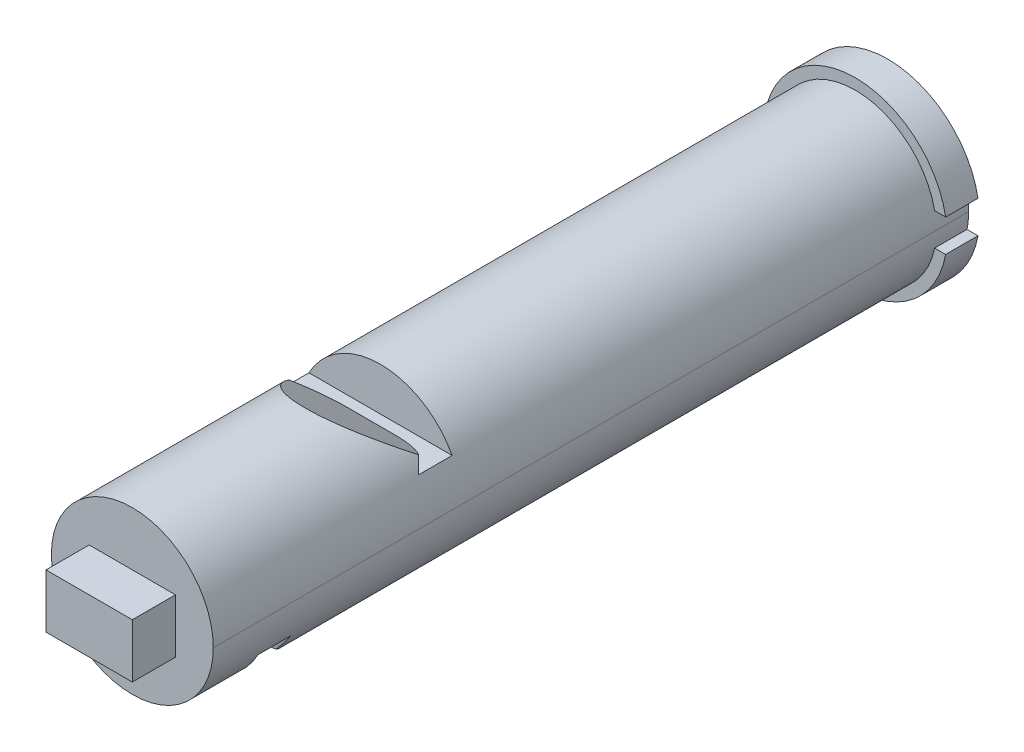
ISO-10303-21;
HEADER;
FILE_DESCRIPTION(('STEP AP214'),'2;1');
FILE_NAME('part.step','',(''),(''),'','','');
FILE_SCHEMA(('AUTOMOTIVE_DESIGN { 1 0 10303 214 1 1 1 1 }'));
ENDSEC;
DATA;
#1=APPLICATION_CONTEXT('core data for automotive mechanical design processes');
#2=APPLICATION_PROTOCOL_DEFINITION('international standard','automotive_design',2000,#1);
#3=PRODUCT_CONTEXT('',#1,'mechanical');
#4=PRODUCT('Part','Part','',(#3));
#5=PRODUCT_RELATED_PRODUCT_CATEGORY('part','',(#4));
#6=PRODUCT_DEFINITION_FORMATION('','',#4);
#7=PRODUCT_DEFINITION_CONTEXT('part definition',#1,'design');
#8=PRODUCT_DEFINITION('design','',#6,#7);
#9=PRODUCT_DEFINITION_SHAPE('','',#8);
#10=(LENGTH_UNIT() NAMED_UNIT(*) SI_UNIT(.MILLI.,.METRE.));
#11=(NAMED_UNIT(*) PLANE_ANGLE_UNIT() SI_UNIT($,.RADIAN.));
#12=(NAMED_UNIT(*) SI_UNIT($,.STERADIAN.) SOLID_ANGLE_UNIT());
#13=UNCERTAINTY_MEASURE_WITH_UNIT(LENGTH_MEASURE(1.E-05),#10,'distance_accuracy_value','');
#14=(GEOMETRIC_REPRESENTATION_CONTEXT(3) GLOBAL_UNCERTAINTY_ASSIGNED_CONTEXT((#13)) GLOBAL_UNIT_ASSIGNED_CONTEXT((#10,
#11,#12)) REPRESENTATION_CONTEXT('',''));
#15=CARTESIAN_POINT('',(0.,0.,0.));
#16=DIRECTION('',(0.,0.,1.));
#17=DIRECTION('',(1.,0.,0.));
#18=AXIS2_PLACEMENT_3D('',#15,#16,#17);
#19=CARTESIAN_POINT('',(0.,0.,74.));
#20=DIRECTION('',(0.,0.,1.));
#21=DIRECTION('',(1.,0.,0.));
#22=AXIS2_PLACEMENT_3D('',#19,#20,#21);
#23=PLANE('',#22);
#24=DIRECTION('',(0.,-1.,0.));
#25=VECTOR('',#24,1.);
#26=CARTESIAN_POINT('',(-4.,2.5,74.));
#27=LINE('',#26,#25);
#28=CARTESIAN_POINT('',(-4.,2.5,74.));
#29=VERTEX_POINT('',#28);
#30=CARTESIAN_POINT('',(-4.,-2.5,74.));
#31=VERTEX_POINT('',#30);
#32=EDGE_CURVE('E247',#29,#31,#27,.T.);
#33=ORIENTED_EDGE('',*,*,#32,.T.);
#34=DIRECTION('',(1.,0.,0.));
#35=VECTOR('',#34,1.);
#36=CARTESIAN_POINT('',(-4.,-2.5,74.));
#37=LINE('',#36,#35);
#38=CARTESIAN_POINT('',(4.,-2.5,74.));
#39=VERTEX_POINT('',#38);
#40=EDGE_CURVE('E214',#31,#39,#37,.T.);
#41=ORIENTED_EDGE('',*,*,#40,.T.);
#42=DIRECTION('',(0.,1.,0.));
#43=VECTOR('',#42,1.);
#44=CARTESIAN_POINT('',(4.,2.5,74.));
#45=LINE('',#44,#43);
#46=CARTESIAN_POINT('',(4.,2.5,74.));
#47=VERTEX_POINT('',#46);
#48=EDGE_CURVE('E27',#39,#47,#45,.T.);
#49=ORIENTED_EDGE('',*,*,#48,.T.);
#50=DIRECTION('',(-1.,0.,0.));
#51=VECTOR('',#50,1.);
#52=CARTESIAN_POINT('',(-4.,2.5,74.));
#53=LINE('',#52,#51);
#54=EDGE_CURVE('E9',#47,#29,#53,.T.);
#55=ORIENTED_EDGE('',*,*,#54,.T.);
#56=EDGE_LOOP('',(#33,#41,#49,#55));
#57=FACE_BOUND('',#56,.T.);
#58=ADVANCED_FACE('F14',(#57),#23,.T.);
#59=CARTESIAN_POINT('',(-4.,2.5,74.));
#60=DIRECTION('',(0.,-1.,0.));
#61=DIRECTION('',(0.,0.,-1.));
#62=AXIS2_PLACEMENT_3D('',#59,#60,#61);
#63=PLANE('',#62);
#64=DIRECTION('',(-1.,0.,0.));
#65=VECTOR('',#64,1.);
#66=CARTESIAN_POINT('',(-4.,2.5,70.));
#67=LINE('',#66,#65);
#68=CARTESIAN_POINT('',(4.,2.5,70.));
#69=VERTEX_POINT('',#68);
#70=CARTESIAN_POINT('',(-4.,2.5,70.));
#71=VERTEX_POINT('',#70);
#72=EDGE_CURVE('E224',#69,#71,#67,.T.);
#73=ORIENTED_EDGE('',*,*,#72,.T.);
#74=DIRECTION('',(0.,0.,-1.));
#75=VECTOR('',#74,1.);
#76=CARTESIAN_POINT('',(-4.,2.5,74.));
#77=LINE('',#76,#75);
#78=EDGE_CURVE('E215',#29,#71,#77,.T.);
#79=ORIENTED_EDGE('',*,*,#78,.F.);
#80=ORIENTED_EDGE('',*,*,#54,.F.);
#81=DIRECTION('',(0.,0.,-1.));
#82=VECTOR('',#81,1.);
#83=CARTESIAN_POINT('',(4.,2.5,74.));
#84=LINE('',#83,#82);
#85=EDGE_CURVE('E298',#47,#69,#84,.T.);
#86=ORIENTED_EDGE('',*,*,#85,.T.);
#87=EDGE_LOOP('',(#73,#79,#80,#86));
#88=FACE_BOUND('',#87,.T.);
#89=ADVANCED_FACE('F562',(#88),#63,.F.);
#90=CARTESIAN_POINT('',(4.,2.5,74.));
#91=DIRECTION('',(-1.,0.,0.));
#92=DIRECTION('',(0.,0.,1.));
#93=AXIS2_PLACEMENT_3D('',#90,#91,#92);
#94=PLANE('',#93);
#95=DIRECTION('',(0.,1.,0.));
#96=VECTOR('',#95,1.);
#97=CARTESIAN_POINT('',(4.,2.5,70.));
#98=LINE('',#97,#96);
#99=CARTESIAN_POINT('',(4.,-2.5,70.));
#100=VERTEX_POINT('',#99);
#101=EDGE_CURVE('E208',#100,#69,#98,.T.);
#102=ORIENTED_EDGE('',*,*,#101,.T.);
#103=ORIENTED_EDGE('',*,*,#85,.F.);
#104=ORIENTED_EDGE('',*,*,#48,.F.);
#105=DIRECTION('',(0.,0.,-1.));
#106=VECTOR('',#105,1.);
#107=CARTESIAN_POINT('',(4.,-2.5,74.));
#108=LINE('',#107,#106);
#109=EDGE_CURVE('E204',#39,#100,#108,.T.);
#110=ORIENTED_EDGE('',*,*,#109,.T.);
#111=EDGE_LOOP('',(#102,#103,#104,#110));
#112=FACE_BOUND('',#111,.T.);
#113=ADVANCED_FACE('F206',(#112),#94,.F.);
#114=CARTESIAN_POINT('',(-4.,-2.5,74.));
#115=DIRECTION('',(0.,1.,0.));
#116=DIRECTION('',(1.,0.,0.));
#117=AXIS2_PLACEMENT_3D('',#114,#115,#116);
#118=PLANE('',#117);
#119=DIRECTION('',(1.,0.,0.));
#120=VECTOR('',#119,1.);
#121=CARTESIAN_POINT('',(-4.,-2.5,70.));
#122=LINE('',#121,#120);
#123=CARTESIAN_POINT('',(-4.,-2.5,70.));
#124=VERTEX_POINT('',#123);
#125=EDGE_CURVE('E222',#124,#100,#122,.T.);
#126=ORIENTED_EDGE('',*,*,#125,.T.);
#127=ORIENTED_EDGE('',*,*,#109,.F.);
#128=ORIENTED_EDGE('',*,*,#40,.F.);
#129=DIRECTION('',(0.,0.,-1.));
#130=VECTOR('',#129,1.);
#131=CARTESIAN_POINT('',(-4.,-2.5,74.));
#132=LINE('',#131,#130);
#133=EDGE_CURVE('E230',#31,#124,#132,.T.);
#134=ORIENTED_EDGE('',*,*,#133,.T.);
#135=EDGE_LOOP('',(#126,#127,#128,#134));
#136=FACE_BOUND('',#135,.T.);
#137=ADVANCED_FACE('F228',(#136),#118,.F.);
#138=CARTESIAN_POINT('',(-4.,2.5,74.));
#139=DIRECTION('',(1.,0.,0.));
#140=DIRECTION('',(0.,1.,0.));
#141=AXIS2_PLACEMENT_3D('',#138,#139,#140);
#142=PLANE('',#141);
#143=DIRECTION('',(0.,-1.,0.));
#144=VECTOR('',#143,1.);
#145=CARTESIAN_POINT('',(-4.,2.5,70.));
#146=LINE('',#145,#144);
#147=EDGE_CURVE('E233',#71,#124,#146,.T.);
#148=ORIENTED_EDGE('',*,*,#147,.T.);
#149=ORIENTED_EDGE('',*,*,#133,.F.);
#150=ORIENTED_EDGE('',*,*,#32,.F.);
#151=ORIENTED_EDGE('',*,*,#78,.T.);
#152=EDGE_LOOP('',(#148,#149,#150,#151));
#153=FACE_BOUND('',#152,.T.);
#154=ADVANCED_FACE('F552',(#153),#142,.F.);
#155=CARTESIAN_POINT('',(-8.36660026534076,-3.5,64.));
#156=DIRECTION('',(0.,0.78086880944303,-0.624695047554425));
#157=DIRECTION('',(-1.,0.,0.));
#158=AXIS2_PLACEMENT_3D('',#155,#156,#157);
#159=PLANE('',#158);
#160=DIRECTION('',(1.,0.,0.));
#161=VECTOR('',#160,1.);
#162=CARTESIAN_POINT('',(0.,-3.5,64.));
#163=LINE('',#162,#161);
#164=CARTESIAN_POINT('',(-2.5,-3.5,64.));
#165=VERTEX_POINT('',#164);
#166=CARTESIAN_POINT('',(2.5,-3.5,64.));
#167=VERTEX_POINT('',#166);
#168=EDGE_CURVE('E258',#165,#167,#163,.T.);
#169=ORIENTED_EDGE('',*,*,#168,.F.);
#170=CARTESIAN_POINT('',(-2.5,-3.5,64.));
#171=CARTESIAN_POINT('',(-3.76535257547479,-3.57826350727732,63.9021706159034));
#172=CARTESIAN_POINT('',(-4.9395349648415,-3.96358078550256,63.4205240181218));
#173=CARTESIAN_POINT('',(-5.90909547281453,-4.61872175966066,62.6015978004242));
#174=(BOUNDED_CURVE() B_SPLINE_CURVE(3,(#170,#171,#172,#173),.UNSPECIFIED.,.F.,
.F.) B_SPLINE_CURVE_WITH_KNOTS((4,4),(3.21875309003642,3.84296469095115),
.UNSPECIFIED.) CURVE() GEOMETRIC_REPRESENTATION_ITEM() RATIONAL_B_SPLINE_CURVE((1.,
0.96779271082216,0.96779271082216,1.)) REPRESENTATION_ITEM(''));
#175=CARTESIAN_POINT('',(-5.90909547281453,-4.61872175966066,62.6015978004242));
#176=VERTEX_POINT('',#175);
#177=EDGE_CURVE('E352',#165,#176,#174,.T.);
#178=ORIENTED_EDGE('',*,*,#177,.T.);
#179=CARTESIAN_POINT('',(5.90909547281453,-4.61872175966066,62.6015978004242));
#180=CARTESIAN_POINT('',(2.64784857944101,-8.79109244058685,57.3861344492665));
#181=CARTESIAN_POINT('',(-2.647848579441,-8.79109244058685,57.3861344492665));
#182=CARTESIAN_POINT('',(-5.90909547281453,-4.61872175966066,62.6015978004242));
#183=(BOUNDED_CURVE() B_SPLINE_CURVE(3,(#179,#180,#181,#182),.UNSPECIFIED.,.F.,
.F.) B_SPLINE_CURVE_WITH_KNOTS((4,4),(5.37582742653039,7.19054318782878),
.UNSPECIFIED.) CURVE() GEOMETRIC_REPRESENTATION_ITEM() RATIONAL_B_SPLINE_CURVE((1.,
0.743886378636503,0.743886378636503,1.)) REPRESENTATION_ITEM(''));
#184=CARTESIAN_POINT('',(5.90909547281453,-4.61872175966066,62.6015978004242));
#185=VERTEX_POINT('',#184);
#186=EDGE_CURVE('E513',#185,#176,#183,.T.);
#187=ORIENTED_EDGE('',*,*,#186,.F.);
#188=CARTESIAN_POINT('',(2.5,-3.5,64.));
#189=CARTESIAN_POINT('',(3.7653525754748,-3.57826350727732,63.9021706159034));
#190=CARTESIAN_POINT('',(4.9395349648415,-3.96358078550256,63.4205240181218));
#191=CARTESIAN_POINT('',(5.90909547281453,-4.61872175966066,62.6015978004242));
#192=(BOUNDED_CURVE() B_SPLINE_CURVE(3,(#188,#189,#190,#191),.UNSPECIFIED.,.F.,
.F.) B_SPLINE_CURVE_WITH_KNOTS((4,4),(3.21875309003642,3.84296469095115),
.UNSPECIFIED.) CURVE() GEOMETRIC_REPRESENTATION_ITEM() RATIONAL_B_SPLINE_CURVE((1.,
0.96779271082216,0.96779271082216,1.)) REPRESENTATION_ITEM(''));
#193=EDGE_CURVE('E365',#167,#185,#192,.T.);
#194=ORIENTED_EDGE('',*,*,#193,.F.);
#195=EDGE_LOOP('',(#169,#178,#187,#194));
#196=FACE_BOUND('',#195,.T.);
#197=ADVANCED_FACE('F331',(#196),#159,.F.);
#198=CARTESIAN_POINT('',(0.,-3.5,0.));
#199=DIRECTION('',(0.,1.,0.));
#200=DIRECTION('',(1.,0.,0.));
#201=AXIS2_PLACEMENT_3D('',#198,#199,#200);
#202=PLANE('',#201);
#203=CARTESIAN_POINT('',(-2.03749663721766,-3.5,58.0178523388824));
#204=DIRECTION('',(0.,-1.,0.));
#205=DIRECTION('',(0.,0.,1.));
#206=AXIS2_PLACEMENT_3D('',#203,#204,#205);
#207=CIRCLE('',#206,6.);
#208=CARTESIAN_POINT('',(-6.6332495807108,-3.5,61.8751901361688));
#209=VERTEX_POINT('',#208);
#210=EDGE_CURVE('E343',#165,#209,#207,.T.);
#211=ORIENTED_EDGE('',*,*,#210,.F.);
#212=ORIENTED_EDGE('',*,*,#168,.T.);
#213=CARTESIAN_POINT('',(2.03749663721766,-3.5,58.0178523388824));
#214=DIRECTION('',(0.,1.,0.));
#215=DIRECTION('',(0.,0.,1.));
#216=AXIS2_PLACEMENT_3D('',#213,#214,#215);
#217=CIRCLE('',#216,6.);
#218=CARTESIAN_POINT('',(6.6332495807108,-3.5,61.8751901361688));
#219=VERTEX_POINT('',#218);
#220=EDGE_CURVE('E528',#167,#219,#217,.T.);
#221=ORIENTED_EDGE('',*,*,#220,.T.);
#222=DIRECTION('',(0.,0.,-1.));
#223=VECTOR('',#222,1.);
#224=CARTESIAN_POINT('',(6.6332495807108,-3.5,70.));
#225=LINE('',#224,#223);
#226=CARTESIAN_POINT('',(6.6332495807108,-3.5,65.));
#227=VERTEX_POINT('',#226);
#228=EDGE_CURVE('E531',#227,#219,#225,.T.);
#229=ORIENTED_EDGE('',*,*,#228,.F.);
#230=DIRECTION('',(1.,0.,0.));
#231=VECTOR('',#230,1.);
#232=CARTESIAN_POINT('',(0.,-3.5,65.));
#233=LINE('',#232,#231);
#234=CARTESIAN_POINT('',(-6.6332495807108,-3.5,65.));
#235=VERTEX_POINT('',#234);
#236=EDGE_CURVE('E262',#235,#227,#233,.T.);
#237=ORIENTED_EDGE('',*,*,#236,.F.);
#238=DIRECTION('',(0.,0.,1.));
#239=VECTOR('',#238,1.);
#240=CARTESIAN_POINT('',(-6.6332495807108,-3.5,70.));
#241=LINE('',#240,#239);
#242=EDGE_CURVE('E355',#209,#235,#241,.T.);
#243=ORIENTED_EDGE('',*,*,#242,.F.);
#244=EDGE_LOOP('',(#211,#212,#221,#229,#237,#243));
#245=FACE_BOUND('',#244,.T.);
#246=ADVANCED_FACE('F333',(#245),#202,.F.);
#247=CARTESIAN_POINT('',(0.,-3.5,65.));
#248=DIRECTION('',(0.,0.,-1.));
#249=DIRECTION('',(0.,-1.,0.));
#250=AXIS2_PLACEMENT_3D('',#247,#248,#249);
#251=PLANE('',#250);
#252=ORIENTED_EDGE('',*,*,#236,.T.);
#253=CARTESIAN_POINT('',(0.,0.,65.));
#254=DIRECTION('',(0.,0.,-1.));
#255=DIRECTION('',(-1.,0.,0.));
#256=AXIS2_PLACEMENT_3D('',#253,#254,#255);
#257=CIRCLE('',#256,7.5);
#258=EDGE_CURVE('E359',#227,#235,#257,.T.);
#259=ORIENTED_EDGE('',*,*,#258,.T.);
#260=EDGE_LOOP('',(#252,#259));
#261=FACE_BOUND('',#260,.T.);
#262=ADVANCED_FACE('F496',(#261),#251,.T.);
#263=CARTESIAN_POINT('',(-2.03749663721766,-3.5,58.0178523388824));
#264=DIRECTION('',(0.,-1.,0.));
#265=DIRECTION('',(0.,0.,-1.));
#266=AXIS2_PLACEMENT_3D('',#263,#264,#265);
#267=CYLINDRICAL_SURFACE('',#266,6.);
#268=ORIENTED_EDGE('',*,*,#177,.F.);
#269=ORIENTED_EDGE('',*,*,#210,.T.);
#270=CARTESIAN_POINT('',(-6.63324958071079,-3.5,61.8751901361688));
#271=CARTESIAN_POINT('',(-6.60766445779467,-3.54848999734944,61.9056732477275));
#272=CARTESIAN_POINT('',(-6.58155732357122,-3.59670137673546,61.9361620128673));
#273=CARTESIAN_POINT('',(-6.52822835245083,-3.69266909430324,61.9971705534921));
#274=CARTESIAN_POINT('',(-6.50100414653086,-3.74042416921239,62.0276902451331));
#275=CARTESIAN_POINT('',(-6.44541754870242,-3.83547927883045,62.0887172353045));
#276=CARTESIAN_POINT('',(-6.41705255090779,-3.88277792522175,62.1192243233681));
#277=CARTESIAN_POINT('',(-6.35916230193235,-3.97692033582182,62.1801806790338));
#278=CARTESIAN_POINT('',(-6.32963420978387,-4.02376258647017,62.2106295866339));
#279=CARTESIAN_POINT('',(-6.26939660479633,-4.11699231932294,62.2714224690449));
#280=CARTESIAN_POINT('',(-6.23868401755144,-4.1633781623944,62.3017659118861));
#281=CARTESIAN_POINT('',(-6.17605748138752,-4.25569521629385,62.3622989559095));
#282=CARTESIAN_POINT('',(-6.14414022822785,-4.30162466260147,62.3924878301928));
#283=CARTESIAN_POINT('',(-6.07908550729933,-4.39302901431333,62.4526610853297));
#284=CARTESIAN_POINT('',(-6.04594450974329,-4.43850203012709,62.4826445213913));
#285=CARTESIAN_POINT('',(-5.97842543548276,-4.52899376853106,62.5423543763314));
#286=CARTESIAN_POINT('',(-5.94404361172873,-4.57401047774772,62.5720796090721));
#287=CARTESIAN_POINT('',(-5.90909547281453,-4.61872175966066,62.6015978004242));
#288=B_SPLINE_CURVE_WITH_KNOTS('',3,(#270,#271,#272,#273,#274,#275,#276,#277,#278,#279,#280,
#281,#282,#283,#284,#285,#286,#287),.UNSPECIFIED.,.F.,.F.,(4,2,2,2,2,2,2,2,4),(0.,
0.18818873002691,0.376799584578778,0.565868922970052,0.755432840483016,0.945527150449584,
1.1361873670971,1.32744868918957,1.51934598449119),.UNSPECIFIED.);
#289=EDGE_CURVE('E360',#209,#176,#288,.T.);
#290=ORIENTED_EDGE('',*,*,#289,.T.);
#291=EDGE_LOOP('',(#268,#269,#290));
#292=FACE_BOUND('',#291,.T.);
#293=ADVANCED_FACE('F492',(#292),#267,.T.);
#294=CARTESIAN_POINT('',(2.03749663721766,-3.5,58.0178523388824));
#295=DIRECTION('',(0.,-1.,0.));
#296=DIRECTION('',(0.,0.,-1.));
#297=AXIS2_PLACEMENT_3D('',#294,#295,#296);
#298=CYLINDRICAL_SURFACE('',#297,6.);
#299=ORIENTED_EDGE('',*,*,#220,.F.);
#300=ORIENTED_EDGE('',*,*,#193,.T.);
#301=CARTESIAN_POINT('',(6.6332495807108,-3.5,61.8751901361688));
#302=CARTESIAN_POINT('',(6.59994174456403,-3.56312517064248,61.9148690724093));
#303=CARTESIAN_POINT('',(6.56572889529886,-3.62578298119048,61.9545312227294));
#304=CARTESIAN_POINT('',(6.50070564838672,-3.74092591804646,62.0279096757643));
#305=CARTESIAN_POINT('',(6.47014164196022,-3.79354345265774,62.0616367252062));
#306=CARTESIAN_POINT('',(6.41314301273647,-3.88897490838058,62.1231509953634));
#307=CARTESIAN_POINT('',(6.38691409372833,-3.93190309895028,62.1509516409813));
#308=CARTESIAN_POINT('',(6.33917470360601,-4.00829689832601,62.2005959118438));
#309=CARTESIAN_POINT('',(6.31783256037368,-4.0418531050118,62.2224622258888));
#310=CARTESIAN_POINT('',(6.26351526881085,-4.12577205314536,62.2772229485628));
#311=CARTESIAN_POINT('',(6.23017409402149,-4.17595115646073,62.3100367801728));
#312=CARTESIAN_POINT('',(6.16402383449918,-4.27294628912458,62.3736361971242));
#313=CARTESIAN_POINT('',(6.13128180616043,-4.31979855667613,62.4044363270807));
#314=CARTESIAN_POINT('',(6.06651954703337,-4.41024454789595,62.4639940323651));
#315=CARTESIAN_POINT('',(6.03456315543465,-4.45387274674841,62.4927686420104));
#316=CARTESIAN_POINT('',(5.97155111165617,-4.5379697154745,62.5482720189896));
#317=CARTESIAN_POINT('',(5.94055613630613,-4.57847121701588,62.5750201024425));
#318=CARTESIAN_POINT('',(5.90909547281454,-4.61872175966065,62.6015978004242));
#319=B_SPLINE_CURVE_WITH_KNOTS('',3,(#301,#302,#303,#304,#305,#306,#307,#308,#309,#310,#311,
#312,#313,#314,#315,#316,#317,#318),.UNSPECIFIED.,.F.,.F.,(4,2,2,2,2,2,2,2,4),(0.,
0.24497748672245,0.453678065600906,0.626101316091831,0.762247169424045,0.968037802030301,
1.16281237113585,1.34657563843075,1.51933328965343),.UNSPECIFIED.);
#320=EDGE_CURVE('E313',#219,#185,#319,.T.);
#321=ORIENTED_EDGE('',*,*,#320,.F.);
#322=EDGE_LOOP('',(#299,#300,#321));
#323=FACE_BOUND('',#322,.T.);
#324=ADVANCED_FACE('F495',(#323),#298,.T.);
#325=CARTESIAN_POINT('',(-8.36660026534076,-19.7307692307693,13.1538461538462));
#326=DIRECTION('',(0.,0.832050294337844,-0.554700196225229));
#327=DIRECTION('',(-1.,0.,0.));
#328=AXIS2_PLACEMENT_3D('',#325,#326,#327);
#329=PLANE('',#328);
#330=CARTESIAN_POINT('',(6.00805782338563,4.48923614781566,49.4838542217235));
#331=CARTESIAN_POINT('',(5.02218679058538,3.90909595166588,48.6136439274989));
#332=CARTESIAN_POINT('',(3.81108078485515,3.56757654120511,48.1013648118077));
#333=CARTESIAN_POINT('',(2.5,3.5,48.));
#334=(BOUNDED_CURVE() B_SPLINE_CURVE(3,(#330,#331,#332,#333),.UNSPECIFIED.,.F.,
.F.) B_SPLINE_CURVE_WITH_KNOTS((4,4),(2.4184284976934,3.06443221714317),
.UNSPECIFIED.) CURVE() GEOMETRIC_REPRESENTATION_ITEM() RATIONAL_B_SPLINE_CURVE((1.,
0.965524571971836,0.965524571971836,1.)) REPRESENTATION_ITEM(''));
#335=CARTESIAN_POINT('',(6.00805782338563,4.48923614781566,49.4838542217235));
#336=VERTEX_POINT('',#335);
#337=CARTESIAN_POINT('',(2.5,3.5,48.));
#338=VERTEX_POINT('',#337);
#339=EDGE_CURVE('E431',#336,#338,#334,.T.);
#340=ORIENTED_EDGE('',*,*,#339,.T.);
#341=DIRECTION('',(1.,0.,0.));
#342=VECTOR('',#341,1.);
#343=CARTESIAN_POINT('',(0.,3.5,48.));
#344=LINE('',#343,#342);
#345=CARTESIAN_POINT('',(-2.5,3.5,48.));
#346=VERTEX_POINT('',#345);
#347=EDGE_CURVE('E81',#346,#338,#344,.T.);
#348=ORIENTED_EDGE('',*,*,#347,.F.);
#349=CARTESIAN_POINT('',(-6.00805782338563,4.48923614781565,49.4838542217235));
#350=CARTESIAN_POINT('',(-5.02218679058539,3.90909595166589,48.6136439274988));
#351=CARTESIAN_POINT('',(-3.81108078485515,3.5675765412051,48.1013648118077));
#352=CARTESIAN_POINT('',(-2.5,3.5,48.));
#353=(BOUNDED_CURVE() B_SPLINE_CURVE(3,(#349,#350,#351,#352),.UNSPECIFIED.,.F.,
.F.) B_SPLINE_CURVE_WITH_KNOTS((4,4),(2.4184284976934,3.06443221714316),
.UNSPECIFIED.) CURVE() GEOMETRIC_REPRESENTATION_ITEM() RATIONAL_B_SPLINE_CURVE((1.,
0.965524571971837,0.965524571971837,1.)) REPRESENTATION_ITEM(''));
#354=CARTESIAN_POINT('',(-6.00805782338563,4.48923614781565,49.4838542217235));
#355=VERTEX_POINT('',#354);
#356=EDGE_CURVE('E416',#355,#346,#353,.T.);
#357=ORIENTED_EDGE('',*,*,#356,.F.);
#358=CARTESIAN_POINT('',(-6.00805782338563,4.48923614781565,49.4838542217235));
#359=CARTESIAN_POINT('',(-2.73450310605179,8.87031688898545,56.0554753334781));
#360=CARTESIAN_POINT('',(2.73450310605179,8.87031688898546,56.0554753334781));
#361=CARTESIAN_POINT('',(6.00805782338563,4.48923614781566,49.4838542217235));
#362=(BOUNDED_CURVE() B_SPLINE_CURVE(3,(#358,#359,#360,#361),.UNSPECIFIED.,.F.,
.F.) B_SPLINE_CURVE_WITH_KNOTS((4,4),(2.212504664524,4.07068064265559),
.UNSPECIFIED.) CURVE() GEOMETRIC_REPRESENTATION_ITEM() RATIONAL_B_SPLINE_CURVE((1.,
0.732376546472503,0.732376546472503,1.)) REPRESENTATION_ITEM(''));
#363=EDGE_CURVE('E252',#355,#336,#362,.T.);
#364=ORIENTED_EDGE('',*,*,#363,.T.);
#365=EDGE_LOOP('',(#340,#348,#357,#364));
#366=FACE_BOUND('',#365,.T.);
#367=ADVANCED_FACE('F549',(#366),#329,.T.);
#368=CARTESIAN_POINT('',(0.,3.5,0.));
#369=DIRECTION('',(0.,-1.,0.));
#370=DIRECTION('',(0.,0.,-1.));
#371=AXIS2_PLACEMENT_3D('',#368,#369,#370);
#372=PLANE('',#371);
#373=DIRECTION('',(1.,0.,0.));
#374=VECTOR('',#373,1.);
#375=CARTESIAN_POINT('',(0.,3.5,47.));
#376=LINE('',#375,#374);
#377=CARTESIAN_POINT('',(-6.6332495807108,3.5,47.));
#378=VERTEX_POINT('',#377);
#379=CARTESIAN_POINT('',(6.6332495807108,3.5,47.));
#380=VERTEX_POINT('',#379);
#381=EDGE_CURVE('E607',#378,#380,#376,.T.);
#382=ORIENTED_EDGE('',*,*,#381,.F.);
#383=DIRECTION('',(0.,0.,-1.));
#384=VECTOR('',#383,1.);
#385=CARTESIAN_POINT('',(-6.6332495807108,3.5,70.));
#386=LINE('',#385,#384);
#387=CARTESIAN_POINT('',(-6.6332495807108,3.5,50.1248098638313));
#388=VERTEX_POINT('',#387);
#389=EDGE_CURVE('E277',#388,#378,#386,.T.);
#390=ORIENTED_EDGE('',*,*,#389,.F.);
#391=CARTESIAN_POINT('',(-2.03749663721766,3.5,53.9821476611176));
#392=DIRECTION('',(0.,1.,0.));
#393=DIRECTION('',(0.,0.,-1.));
#394=AXIS2_PLACEMENT_3D('',#391,#392,#393);
#395=CIRCLE('',#394,6.);
#396=EDGE_CURVE('E406',#346,#388,#395,.T.);
#397=ORIENTED_EDGE('',*,*,#396,.F.);
#398=ORIENTED_EDGE('',*,*,#347,.T.);
#399=CARTESIAN_POINT('',(2.03749663721766,3.5,53.9821476611176));
#400=DIRECTION('',(0.,-1.,0.));
#401=DIRECTION('',(0.,0.,-1.));
#402=AXIS2_PLACEMENT_3D('',#399,#400,#401);
#403=CIRCLE('',#402,6.);
#404=CARTESIAN_POINT('',(6.6332495807108,3.5,50.1248098638313));
#405=VERTEX_POINT('',#404);
#406=EDGE_CURVE('E426',#338,#405,#403,.T.);
#407=ORIENTED_EDGE('',*,*,#406,.T.);
#408=DIRECTION('',(0.,0.,1.));
#409=VECTOR('',#408,1.);
#410=CARTESIAN_POINT('',(6.6332495807108,3.5,70.));
#411=LINE('',#410,#409);
#412=EDGE_CURVE('E276',#380,#405,#411,.T.);
#413=ORIENTED_EDGE('',*,*,#412,.F.);
#414=EDGE_LOOP('',(#382,#390,#397,#398,#407,#413));
#415=FACE_BOUND('',#414,.T.);
#416=ADVANCED_FACE('F482',(#415),#372,.F.);
#417=CARTESIAN_POINT('',(0.,3.5,47.));
#418=DIRECTION('',(0.,0.,1.));
#419=DIRECTION('',(1.,0.,0.));
#420=AXIS2_PLACEMENT_3D('',#417,#418,#419);
#421=PLANE('',#420);
#422=ORIENTED_EDGE('',*,*,#381,.T.);
#423=CARTESIAN_POINT('',(0.,0.,47.));
#424=DIRECTION('',(0.,0.,1.));
#425=DIRECTION('',(1.,0.,0.));
#426=AXIS2_PLACEMENT_3D('',#423,#424,#425);
#427=CIRCLE('',#426,7.5);
#428=EDGE_CURVE('E272',#380,#378,#427,.T.);
#429=ORIENTED_EDGE('',*,*,#428,.T.);
#430=EDGE_LOOP('',(#422,#429));
#431=FACE_BOUND('',#430,.T.);
#432=ADVANCED_FACE('F478',(#431),#421,.T.);
#433=CARTESIAN_POINT('',(0.,0.,3.));
#434=DIRECTION('',(0.,0.,-1.));
#435=DIRECTION('',(0.,-1.,0.));
#436=AXIS2_PLACEMENT_3D('',#433,#434,#435);
#437=PLANE('',#436);
#438=DIRECTION('',(-1.,0.,0.));
#439=VECTOR('',#438,1.);
#440=CARTESIAN_POINT('',(0.,-1.5,3.));
#441=LINE('',#440,#439);
#442=CARTESIAN_POINT('',(8.36660026534076,-1.5,3.));
#443=VERTEX_POINT('',#442);
#444=CARTESIAN_POINT('',(7.34846922834953,-1.5,3.));
#445=VERTEX_POINT('',#444);
#446=EDGE_CURVE('E282',#443,#445,#441,.T.);
#447=ORIENTED_EDGE('',*,*,#446,.T.);
#448=CARTESIAN_POINT('',(0.,0.,3.));
#449=DIRECTION('',(0.,0.,-1.));
#450=DIRECTION('',(-1.,0.,0.));
#451=AXIS2_PLACEMENT_3D('',#448,#449,#450);
#452=CIRCLE('',#451,7.5);
#453=CARTESIAN_POINT('',(-7.34846922834953,-1.5,3.));
#454=VERTEX_POINT('',#453);
#455=EDGE_CURVE('E271',#445,#454,#452,.T.);
#456=ORIENTED_EDGE('',*,*,#455,.T.);
#457=DIRECTION('',(-1.,0.,0.));
#458=VECTOR('',#457,1.);
#459=CARTESIAN_POINT('',(0.,-1.5,3.));
#460=LINE('',#459,#458);
#461=CARTESIAN_POINT('',(-8.36660026534076,-1.5,3.));
#462=VERTEX_POINT('',#461);
#463=EDGE_CURVE('E608',#454,#462,#460,.T.);
#464=ORIENTED_EDGE('',*,*,#463,.T.);
#465=CARTESIAN_POINT('',(0.,0.,3.));
#466=DIRECTION('',(0.,0.,-1.));
#467=DIRECTION('',(-1.,0.,0.));
#468=AXIS2_PLACEMENT_3D('',#465,#466,#467);
#469=CIRCLE('',#468,8.5);
#470=EDGE_CURVE('E603',#443,#462,#469,.T.);
#471=ORIENTED_EDGE('',*,*,#470,.F.);
#472=EDGE_LOOP('',(#447,#456,#464,#471));
#473=FACE_BOUND('',#472,.T.);
#474=ADVANCED_FACE('F481',(#473),#437,.F.);
#475=CARTESIAN_POINT('',(0.,0.,3.));
#476=DIRECTION('',(0.,0.,-1.));
#477=DIRECTION('',(-1.,0.,0.));
#478=AXIS2_PLACEMENT_3D('',#475,#476,#477);
#479=CYLINDRICAL_SURFACE('',#478,8.5);
#480=CARTESIAN_POINT('',(0.,0.,0.));
#481=DIRECTION('',(0.,0.,-1.));
#482=DIRECTION('',(-1.,0.,0.));
#483=AXIS2_PLACEMENT_3D('',#480,#481,#482);
#484=CIRCLE('',#483,8.5);
#485=CARTESIAN_POINT('',(8.36660026534076,-1.5,0.));
#486=VERTEX_POINT('',#485);
#487=CARTESIAN_POINT('',(-8.36660026534076,-1.5,0.));
#488=VERTEX_POINT('',#487);
#489=EDGE_CURVE('E306',#486,#488,#484,.T.);
#490=ORIENTED_EDGE('',*,*,#489,.F.);
#491=DIRECTION('',(0.,0.,-1.));
#492=VECTOR('',#491,1.);
#493=CARTESIAN_POINT('',(8.36660026534076,-1.5,3.));
#494=LINE('',#493,#492);
#495=EDGE_CURVE('E622',#443,#486,#494,.T.);
#496=ORIENTED_EDGE('',*,*,#495,.F.);
#497=ORIENTED_EDGE('',*,*,#470,.T.);
#498=DIRECTION('',(0.,0.,-1.));
#499=VECTOR('',#498,1.);
#500=CARTESIAN_POINT('',(-8.36660026534076,-1.5,3.));
#501=LINE('',#500,#499);
#502=EDGE_CURVE('E618',#462,#488,#501,.T.);
#503=ORIENTED_EDGE('',*,*,#502,.T.);
#504=EDGE_LOOP('',(#490,#496,#497,#503));
#505=FACE_BOUND('',#504,.T.);
#506=ADVANCED_FACE('F556',(#505),#479,.T.);
#507=CARTESIAN_POINT('',(0.,-1.5,3.));
#508=DIRECTION('',(0.,-1.,0.));
#509=DIRECTION('',(0.,0.,-1.));
#510=AXIS2_PLACEMENT_3D('',#507,#508,#509);
#511=PLANE('',#510);
#512=DIRECTION('',(-1.,0.,0.));
#513=VECTOR('',#512,1.);
#514=CARTESIAN_POINT('',(0.,-1.5,0.));
#515=LINE('',#514,#513);
#516=CARTESIAN_POINT('',(-7.34846922834953,-1.5,0.));
#517=VERTEX_POINT('',#516);
#518=EDGE_CURVE('E301',#517,#488,#515,.T.);
#519=ORIENTED_EDGE('',*,*,#518,.T.);
#520=ORIENTED_EDGE('',*,*,#502,.F.);
#521=ORIENTED_EDGE('',*,*,#463,.F.);
#522=DIRECTION('',(0.,0.,-1.));
#523=VECTOR('',#522,1.);
#524=CARTESIAN_POINT('',(-7.34846922834953,-1.5,3.));
#525=LINE('',#524,#523);
#526=EDGE_CURVE('E294',#454,#517,#525,.T.);
#527=ORIENTED_EDGE('',*,*,#526,.T.);
#528=EDGE_LOOP('',(#519,#520,#521,#527));
#529=FACE_BOUND('',#528,.T.);
#530=ADVANCED_FACE('F16',(#529),#511,.F.);
#531=CARTESIAN_POINT('',(0.,-1.5,3.));
#532=DIRECTION('',(0.,-1.,0.));
#533=DIRECTION('',(0.,0.,-1.));
#534=AXIS2_PLACEMENT_3D('',#531,#532,#533);
#535=PLANE('',#534);
#536=DIRECTION('',(-1.,0.,0.));
#537=VECTOR('',#536,1.);
#538=CARTESIAN_POINT('',(0.,-1.5,0.));
#539=LINE('',#538,#537);
#540=CARTESIAN_POINT('',(7.34846922834953,-1.5,0.));
#541=VERTEX_POINT('',#540);
#542=EDGE_CURVE('E612',#486,#541,#539,.T.);
#543=ORIENTED_EDGE('',*,*,#542,.T.);
#544=DIRECTION('',(0.,0.,-1.));
#545=VECTOR('',#544,1.);
#546=CARTESIAN_POINT('',(7.34846922834953,-1.5,3.));
#547=LINE('',#546,#545);
#548=EDGE_CURVE('E268',#445,#541,#547,.T.);
#549=ORIENTED_EDGE('',*,*,#548,.F.);
#550=ORIENTED_EDGE('',*,*,#446,.F.);
#551=ORIENTED_EDGE('',*,*,#495,.T.);
#552=EDGE_LOOP('',(#543,#549,#550,#551));
#553=FACE_BOUND('',#552,.T.);
#554=ADVANCED_FACE('F396',(#553),#535,.F.);
#555=CARTESIAN_POINT('',(0.,0.,3.));
#556=DIRECTION('',(0.,0.,-1.));
#557=DIRECTION('',(0.,-1.,0.));
#558=AXIS2_PLACEMENT_3D('',#555,#556,#557);
#559=PLANE('',#558);
#560=DIRECTION('',(1.,0.,0.));
#561=VECTOR('',#560,1.);
#562=CARTESIAN_POINT('',(0.,1.5,3.));
#563=LINE('',#562,#561);
#564=CARTESIAN_POINT('',(-8.36660026534076,1.5,3.));
#565=VERTEX_POINT('',#564);
#566=CARTESIAN_POINT('',(-7.34846922834953,1.5,3.));
#567=VERTEX_POINT('',#566);
#568=EDGE_CURVE('E305',#565,#567,#563,.T.);
#569=ORIENTED_EDGE('',*,*,#568,.T.);
#570=CARTESIAN_POINT('',(0.,0.,3.));
#571=DIRECTION('',(0.,0.,-1.));
#572=DIRECTION('',(-1.,0.,0.));
#573=AXIS2_PLACEMENT_3D('',#570,#571,#572);
#574=CIRCLE('',#573,7.5);
#575=CARTESIAN_POINT('',(7.34846922834953,1.5,3.));
#576=VERTEX_POINT('',#575);
#577=EDGE_CURVE('E583',#567,#576,#574,.T.);
#578=ORIENTED_EDGE('',*,*,#577,.T.);
#579=DIRECTION('',(1.,0.,0.));
#580=VECTOR('',#579,1.);
#581=CARTESIAN_POINT('',(0.,1.5,3.));
#582=LINE('',#581,#580);
#583=CARTESIAN_POINT('',(8.36660026534076,1.5,3.));
#584=VERTEX_POINT('',#583);
#585=EDGE_CURVE('E283',#576,#584,#582,.T.);
#586=ORIENTED_EDGE('',*,*,#585,.T.);
#587=CARTESIAN_POINT('',(0.,0.,3.));
#588=DIRECTION('',(0.,0.,-1.));
#589=DIRECTION('',(-1.,0.,0.));
#590=AXIS2_PLACEMENT_3D('',#587,#588,#589);
#591=CIRCLE('',#590,8.5);
#592=EDGE_CURVE('E278',#565,#584,#591,.T.);
#593=ORIENTED_EDGE('',*,*,#592,.F.);
#594=EDGE_LOOP('',(#569,#578,#586,#593));
#595=FACE_BOUND('',#594,.T.);
#596=ADVANCED_FACE('F490',(#595),#559,.F.);
#597=CARTESIAN_POINT('',(0.,0.,3.));
#598=DIRECTION('',(0.,0.,-1.));
#599=DIRECTION('',(-1.,0.,0.));
#600=AXIS2_PLACEMENT_3D('',#597,#598,#599);
#601=CYLINDRICAL_SURFACE('',#600,8.5);
#602=CARTESIAN_POINT('',(0.,0.,0.));
#603=DIRECTION('',(0.,0.,-1.));
#604=DIRECTION('',(-1.,0.,0.));
#605=AXIS2_PLACEMENT_3D('',#602,#603,#604);
#606=CIRCLE('',#605,8.5);
#607=CARTESIAN_POINT('',(-8.36660026534076,1.5,0.));
#608=VERTEX_POINT('',#607);
#609=CARTESIAN_POINT('',(8.36660026534076,1.5,0.));
#610=VERTEX_POINT('',#609);
#611=EDGE_CURVE('E630',#608,#610,#606,.T.);
#612=ORIENTED_EDGE('',*,*,#611,.F.);
#613=DIRECTION('',(0.,0.,-1.));
#614=VECTOR('',#613,1.);
#615=CARTESIAN_POINT('',(-8.36660026534076,1.5,3.));
#616=LINE('',#615,#614);
#617=EDGE_CURVE('E63',#565,#608,#616,.T.);
#618=ORIENTED_EDGE('',*,*,#617,.F.);
#619=ORIENTED_EDGE('',*,*,#592,.T.);
#620=DIRECTION('',(0.,0.,-1.));
#621=VECTOR('',#620,1.);
#622=CARTESIAN_POINT('',(8.36660026534076,1.5,3.));
#623=LINE('',#622,#621);
#624=EDGE_CURVE('E286',#584,#610,#623,.T.);
#625=ORIENTED_EDGE('',*,*,#624,.T.);
#626=EDGE_LOOP('',(#612,#618,#619,#625));
#627=FACE_BOUND('',#626,.T.);
#628=ADVANCED_FACE('F488',(#627),#601,.T.);
#629=CARTESIAN_POINT('',(0.,1.5,3.));
#630=DIRECTION('',(0.,1.,0.));
#631=DIRECTION('',(1.,0.,0.));
#632=AXIS2_PLACEMENT_3D('',#629,#630,#631);
#633=PLANE('',#632);
#634=DIRECTION('',(1.,0.,0.));
#635=VECTOR('',#634,1.);
#636=CARTESIAN_POINT('',(0.,1.5,0.));
#637=LINE('',#636,#635);
#638=CARTESIAN_POINT('',(7.34846922834953,1.5,0.));
#639=VERTEX_POINT('',#638);
#640=EDGE_CURVE('E160',#639,#610,#637,.T.);
#641=ORIENTED_EDGE('',*,*,#640,.T.);
#642=ORIENTED_EDGE('',*,*,#624,.F.);
#643=ORIENTED_EDGE('',*,*,#585,.F.);
#644=DIRECTION('',(0.,0.,-1.));
#645=VECTOR('',#644,1.);
#646=CARTESIAN_POINT('',(7.34846922834953,1.5,3.));
#647=LINE('',#646,#645);
#648=EDGE_CURVE('E585',#576,#639,#647,.T.);
#649=ORIENTED_EDGE('',*,*,#648,.T.);
#650=EDGE_LOOP('',(#641,#642,#643,#649));
#651=FACE_BOUND('',#650,.T.);
#652=ADVANCED_FACE('F487',(#651),#633,.F.);
#653=CARTESIAN_POINT('',(0.,1.5,3.));
#654=DIRECTION('',(0.,1.,0.));
#655=DIRECTION('',(1.,0.,0.));
#656=AXIS2_PLACEMENT_3D('',#653,#654,#655);
#657=PLANE('',#656);
#658=DIRECTION('',(1.,0.,0.));
#659=VECTOR('',#658,1.);
#660=CARTESIAN_POINT('',(0.,1.5,0.));
#661=LINE('',#660,#659);
#662=CARTESIAN_POINT('',(-7.34846922834953,1.5,0.));
#663=VERTEX_POINT('',#662);
#664=EDGE_CURVE('E415',#608,#663,#661,.T.);
#665=ORIENTED_EDGE('',*,*,#664,.T.);
#666=DIRECTION('',(0.,0.,-1.));
#667=VECTOR('',#666,1.);
#668=CARTESIAN_POINT('',(-7.34846922834953,1.5,3.));
#669=LINE('',#668,#667);
#670=EDGE_CURVE('E256',#567,#663,#669,.T.);
#671=ORIENTED_EDGE('',*,*,#670,.F.);
#672=ORIENTED_EDGE('',*,*,#568,.F.);
#673=ORIENTED_EDGE('',*,*,#617,.T.);
#674=EDGE_LOOP('',(#665,#671,#672,#673));
#675=FACE_BOUND('',#674,.T.);
#676=ADVANCED_FACE('F484',(#675),#657,.F.);
#677=CARTESIAN_POINT('',(0.,0.,0.));
#678=DIRECTION('',(0.,0.,1.));
#679=DIRECTION('',(1.,0.,0.));
#680=AXIS2_PLACEMENT_3D('',#677,#678,#679);
#681=PLANE('',#680);
#682=CARTESIAN_POINT('',(0.,0.,0.));
#683=DIRECTION('',(0.,0.,1.));
#684=DIRECTION('',(1.,0.,0.));
#685=AXIS2_PLACEMENT_3D('',#682,#683,#684);
#686=CIRCLE('',#685,7.5);
#687=CARTESIAN_POINT('',(-7.5,0.,0.));
#688=VERTEX_POINT('',#687);
#689=EDGE_CURVE('E253',#663,#688,#686,.T.);
#690=ORIENTED_EDGE('',*,*,#689,.F.);
#691=ORIENTED_EDGE('',*,*,#664,.F.);
#692=ORIENTED_EDGE('',*,*,#611,.T.);
#693=ORIENTED_EDGE('',*,*,#640,.F.);
#694=CARTESIAN_POINT('',(0.,0.,0.));
#695=DIRECTION('',(0.,0.,1.));
#696=DIRECTION('',(1.,0.,0.));
#697=AXIS2_PLACEMENT_3D('',#694,#695,#696);
#698=CIRCLE('',#697,7.5);
#699=CARTESIAN_POINT('',(7.5,0.,0.));
#700=VERTEX_POINT('',#699);
#701=EDGE_CURVE('E587',#700,#639,#698,.T.);
#702=ORIENTED_EDGE('',*,*,#701,.F.);
#703=CARTESIAN_POINT('',(0.,0.,0.));
#704=DIRECTION('',(0.,0.,1.));
#705=DIRECTION('',(1.,0.,0.));
#706=AXIS2_PLACEMENT_3D('',#703,#704,#705);
#707=CIRCLE('',#706,7.5);
#708=EDGE_CURVE('E148',#541,#700,#707,.T.);
#709=ORIENTED_EDGE('',*,*,#708,.F.);
#710=ORIENTED_EDGE('',*,*,#542,.F.);
#711=ORIENTED_EDGE('',*,*,#489,.T.);
#712=ORIENTED_EDGE('',*,*,#518,.F.);
#713=CARTESIAN_POINT('',(0.,0.,0.));
#714=DIRECTION('',(0.,0.,1.));
#715=DIRECTION('',(1.,0.,0.));
#716=AXIS2_PLACEMENT_3D('',#713,#714,#715);
#717=CIRCLE('',#716,7.5);
#718=EDGE_CURVE('E226',#688,#517,#717,.T.);
#719=ORIENTED_EDGE('',*,*,#718,.F.);
#720=EDGE_LOOP('',(#690,#691,#692,#693,#702,#709,#710,#711,#712,#719));
#721=FACE_BOUND('',#720,.T.);
#722=ADVANCED_FACE('F477',(#721),#681,.F.);
#723=CARTESIAN_POINT('',(-2.03749663721766,3.5,53.9821476611176));
#724=DIRECTION('',(0.,1.,0.));
#725=DIRECTION('',(0.,0.,1.));
#726=AXIS2_PLACEMENT_3D('',#723,#724,#725);
#727=CYLINDRICAL_SURFACE('',#726,6.);
#728=CARTESIAN_POINT('',(-6.63324958071081,3.5,50.1248098638312));
#729=CARTESIAN_POINT('',(-6.61079454322049,3.54255753843681,50.0980560920289));
#730=CARTESIAN_POINT('',(-6.58793640502719,3.58489907230784,50.0712967434522));
#731=CARTESIAN_POINT('',(-6.54134355625961,3.66926249959858,50.0177276247045));
#732=CARTESIAN_POINT('',(-6.51760662219572,3.71128320424169,49.99091791642));
#733=CARTESIAN_POINT('',(-6.4692389883304,3.79500497137029,49.9372783552293));
#734=CARTESIAN_POINT('',(-6.44460591623575,3.83670476835949,49.9104486658148));
#735=CARTESIAN_POINT('',(-6.39442964517609,3.91978481767982,49.8568006760578));
#736=CARTESIAN_POINT('',(-6.36888392719465,3.96116372834479,49.829982653692));
#737=CARTESIAN_POINT('',(-6.31686651884341,4.04360207381852,49.7763906214411));
#738=CARTESIAN_POINT('',(-6.29039216440554,4.0846600911406,49.7496170165011));
#739=CARTESIAN_POINT('',(-6.23650234492834,4.16645673208835,49.696147591391));
#740=CARTESIAN_POINT('',(-6.20908407351067,4.2071938630395,49.6694523158362));
#741=CARTESIAN_POINT('',(-6.15329190464232,4.28834878582282,49.6161744484594));
#742=CARTESIAN_POINT('',(-6.1249150614497,4.32876501044156,49.589592553561));
#743=CARTESIAN_POINT('',(-6.06719238052058,4.40927826875798,49.5365775368385));
#744=CARTESIAN_POINT('',(-6.03784346292225,4.44937366191638,49.5101452770802));
#745=CARTESIAN_POINT('',(-6.00805782338565,4.48923614781565,49.4838542217235));
#746=B_SPLINE_CURVE_WITH_KNOTS('',3,(#728,#729,#730,#731,#732,#733,#734,#735,#736,#737,#738,
#739,#740,#741,#742,#743,#744,#745),.UNSPECIFIED.,.F.,.F.,(4,2,2,2,2,2,2,2,4),(0.,
0.165165618099704,0.330782315518655,0.49687492417168,0.663468063046385,0.830586129808868,
0.998253292858275,1.16649348383611,1.33533039059455),.UNSPECIFIED.);
#747=EDGE_CURVE('E422',#388,#355,#746,.T.);
#748=ORIENTED_EDGE('',*,*,#747,.T.);
#749=ORIENTED_EDGE('',*,*,#356,.T.);
#750=ORIENTED_EDGE('',*,*,#396,.T.);
#751=EDGE_LOOP('',(#748,#749,#750));
#752=FACE_BOUND('',#751,.T.);
#753=ADVANCED_FACE('F468',(#752),#727,.T.);
#754=CARTESIAN_POINT('',(2.03749663721766,3.5,53.9821476611176));
#755=DIRECTION('',(0.,1.,0.));
#756=DIRECTION('',(0.,0.,1.));
#757=AXIS2_PLACEMENT_3D('',#754,#755,#756);
#758=CYLINDRICAL_SURFACE('',#757,6.);
#759=ORIENTED_EDGE('',*,*,#339,.F.);
#760=CARTESIAN_POINT('',(6.63324958071079,3.50000000000001,50.1248098638313));
#761=CARTESIAN_POINT('',(6.6036625199187,3.55607364686985,50.0895623270963));
#762=CARTESIAN_POINT('',(6.57336203475964,3.61177705065797,50.0543251318725));
#763=CARTESIAN_POINT('',(6.51610789225118,3.7139223628584,49.989311028678));
#764=CARTESIAN_POINT('',(6.48935520166592,3.76047241625058,49.9595269155513));
#765=CARTESIAN_POINT('',(6.43978832011726,3.84461422030714,49.9054146286376));
#766=CARTESIAN_POINT('',(6.41714066850279,3.88229832497913,49.8810774347599));
#767=CARTESIAN_POINT('',(6.37626111742593,3.94898291370756,49.8378714262018));
#768=CARTESIAN_POINT('',(6.358163790951,3.97805578854126,49.8189868384139));
#769=CARTESIAN_POINT('',(6.31158956113479,4.05174476753431,49.7710516368882));
#770=CARTESIAN_POINT('',(6.28282091173856,4.09621424485147,49.742058323539));
#771=CARTESIAN_POINT('',(6.22588044584675,4.18221547287961,49.6858314486247));
#772=CARTESIAN_POINT('',(6.19776118552467,4.22377551938951,49.6585878960765));
#773=CARTESIAN_POINT('',(6.14226925033408,4.30404115128424,49.605871291885));
#774=CARTESIAN_POINT('',(6.11494652950218,4.34277352728439,49.5803864630058));
#775=CARTESIAN_POINT('',(6.06118900255233,4.41746231194302,49.5311894695067));
#776=CARTESIAN_POINT('',(6.03480157977968,4.45344402840978,49.5074639349295));
#777=CARTESIAN_POINT('',(6.00805782338562,4.48923614781566,49.4838542217235));
#778=B_SPLINE_CURVE_WITH_KNOTS('',3,(#760,#761,#762,#763,#764,#765,#766,#767,#768,#769,#770,
#771,#772,#773,#774,#775,#776,#777),.UNSPECIFIED.,.F.,.F.,(4,2,2,2,2,2,2,2,4),(0.,
0.217614511253238,0.401797543414694,0.552548700576977,0.669867798783083,0.850997059603499,
1.02228096583017,1.18372201406937,1.33532319716244),.UNSPECIFIED.);
#779=EDGE_CURVE('E243',#405,#336,#778,.T.);
#780=ORIENTED_EDGE('',*,*,#779,.F.);
#781=ORIENTED_EDGE('',*,*,#406,.F.);
#782=EDGE_LOOP('',(#759,#780,#781));
#783=FACE_BOUND('',#782,.T.);
#784=ADVANCED_FACE('F330',(#783),#758,.T.);
#785=CARTESIAN_POINT('',(0.,0.,70.));
#786=DIRECTION('',(0.,0.,-1.));
#787=DIRECTION('',(-1.,0.,0.));
#788=AXIS2_PLACEMENT_3D('',#785,#786,#787);
#789=CYLINDRICAL_SURFACE('',#788,7.5);
#790=ORIENTED_EDGE('',*,*,#186,.T.);
#791=ORIENTED_EDGE('',*,*,#289,.F.);
#792=ORIENTED_EDGE('',*,*,#242,.T.);
#793=ORIENTED_EDGE('',*,*,#258,.F.);
#794=ORIENTED_EDGE('',*,*,#228,.T.);
#795=ORIENTED_EDGE('',*,*,#320,.T.);
#796=EDGE_LOOP('',(#790,#791,#792,#793,#794,#795));
#797=FACE_BOUND('',#796,.T.);
#798=DIRECTION('',(0.,0.,-1.));
#799=VECTOR('',#798,1.);
#800=CARTESIAN_POINT('',(7.5,0.,70.));
#801=LINE('',#800,#799);
#802=CARTESIAN_POINT('',(7.5,0.,70.));
#803=VERTEX_POINT('',#802);
#804=EDGE_CURVE('E267',#803,#700,#801,.T.);
#805=ORIENTED_EDGE('',*,*,#804,.F.);
#806=CARTESIAN_POINT('',(0.,0.,70.));
#807=DIRECTION('',(0.,0.,1.));
#808=DIRECTION('',(1.,0.,0.));
#809=AXIS2_PLACEMENT_3D('',#806,#807,#808);
#810=CIRCLE('',#809,7.5);
#811=CARTESIAN_POINT('',(-7.5,0.,70.));
#812=VERTEX_POINT('',#811);
#813=EDGE_CURVE('E234',#812,#803,#810,.T.);
#814=ORIENTED_EDGE('',*,*,#813,.F.);
#815=DIRECTION('',(0.,0.,-1.));
#816=VECTOR('',#815,1.);
#817=CARTESIAN_POINT('',(-7.5,0.,70.));
#818=LINE('',#817,#816);
#819=EDGE_CURVE('E249',#812,#688,#818,.T.);
#820=ORIENTED_EDGE('',*,*,#819,.T.);
#821=ORIENTED_EDGE('',*,*,#718,.T.);
#822=ORIENTED_EDGE('',*,*,#526,.F.);
#823=ORIENTED_EDGE('',*,*,#455,.F.);
#824=ORIENTED_EDGE('',*,*,#548,.T.);
#825=ORIENTED_EDGE('',*,*,#708,.T.);
#826=EDGE_LOOP('',(#805,#814,#820,#821,#822,#823,#824,#825));
#827=FACE_BOUND('',#826,.T.);
#828=ADVANCED_FACE('F320',(#797,#827),#789,.T.);
#829=CARTESIAN_POINT('',(0.,0.,70.));
#830=DIRECTION('',(0.,0.,1.));
#831=DIRECTION('',(1.,0.,0.));
#832=AXIS2_PLACEMENT_3D('',#829,#830,#831);
#833=PLANE('',#832);
#834=ORIENTED_EDGE('',*,*,#125,.F.);
#835=ORIENTED_EDGE('',*,*,#147,.F.);
#836=ORIENTED_EDGE('',*,*,#72,.F.);
#837=ORIENTED_EDGE('',*,*,#101,.F.);
#838=EDGE_LOOP('',(#834,#835,#836,#837));
#839=FACE_BOUND('',#838,.T.);
#840=ORIENTED_EDGE('',*,*,#813,.T.);
#841=CARTESIAN_POINT('',(0.,0.,70.));
#842=DIRECTION('',(0.,0.,1.));
#843=DIRECTION('',(1.,0.,0.));
#844=AXIS2_PLACEMENT_3D('',#841,#842,#843);
#845=CIRCLE('',#844,7.5);
#846=EDGE_CURVE('E263',#803,#812,#845,.T.);
#847=ORIENTED_EDGE('',*,*,#846,.T.);
#848=EDGE_LOOP('',(#840,#847));
#849=FACE_BOUND('',#848,.T.);
#850=ADVANCED_FACE('F219',(#839,#849),#833,.T.);
#851=CARTESIAN_POINT('',(0.,0.,70.));
#852=DIRECTION('',(0.,0.,-1.));
#853=DIRECTION('',(-1.,0.,0.));
#854=AXIS2_PLACEMENT_3D('',#851,#852,#853);
#855=CYLINDRICAL_SURFACE('',#854,7.5);
#856=ORIENTED_EDGE('',*,*,#363,.F.);
#857=ORIENTED_EDGE('',*,*,#747,.F.);
#858=ORIENTED_EDGE('',*,*,#389,.T.);
#859=ORIENTED_EDGE('',*,*,#428,.F.);
#860=ORIENTED_EDGE('',*,*,#412,.T.);
#861=ORIENTED_EDGE('',*,*,#779,.T.);
#862=EDGE_LOOP('',(#856,#857,#858,#859,#860,#861));
#863=FACE_BOUND('',#862,.T.);
#864=ORIENTED_EDGE('',*,*,#846,.F.);
#865=ORIENTED_EDGE('',*,*,#804,.T.);
#866=ORIENTED_EDGE('',*,*,#701,.T.);
#867=ORIENTED_EDGE('',*,*,#648,.F.);
#868=ORIENTED_EDGE('',*,*,#577,.F.);
#869=ORIENTED_EDGE('',*,*,#670,.T.);
#870=ORIENTED_EDGE('',*,*,#689,.T.);
#871=ORIENTED_EDGE('',*,*,#819,.F.);
#872=EDGE_LOOP('',(#864,#865,#866,#867,#868,#869,#870,#871));
#873=FACE_BOUND('',#872,.T.);
#874=ADVANCED_FACE('F385',(#863,#873),#855,.T.);
#875=CLOSED_SHELL('',(#58,#89,#113,#137,#154,#197,#246,#262,#293,#324,#367,#416,#432,#474,#506,
#530,#554,#596,#628,#652,#676,#722,#753,#784,#828,#850,#874));
#876=MANIFOLD_SOLID_BREP('B1',#875);
#877=ADVANCED_BREP_SHAPE_REPRESENTATION('',(#18,#876),#14);
#878=SHAPE_DEFINITION_REPRESENTATION(#9,#877);
ENDSEC;
END-ISO-10303-21;
